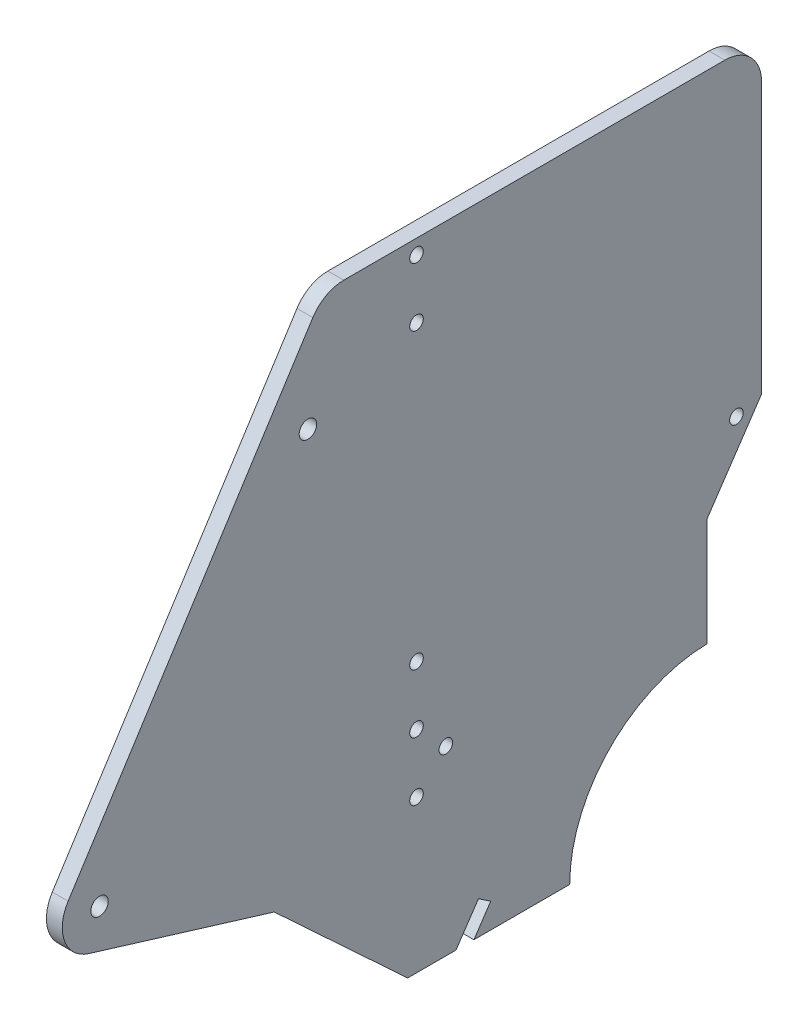
ISO-10303-21;
HEADER;
FILE_DESCRIPTION(('STEP AP214'),'2;1');
FILE_NAME('part.step','',(''),(''),'','','');
FILE_SCHEMA(('AUTOMOTIVE_DESIGN { 1 0 10303 214 1 1 1 1 }'));
ENDSEC;
DATA;
#1=APPLICATION_CONTEXT('core data for automotive mechanical design processes');
#2=APPLICATION_PROTOCOL_DEFINITION('international standard','automotive_design',2000,#1);
#3=PRODUCT_CONTEXT('',#1,'mechanical');
#4=PRODUCT('Part','Part','',(#3));
#5=PRODUCT_RELATED_PRODUCT_CATEGORY('part','',(#4));
#6=PRODUCT_DEFINITION_FORMATION('','',#4);
#7=PRODUCT_DEFINITION_CONTEXT('part definition',#1,'design');
#8=PRODUCT_DEFINITION('design','',#6,#7);
#9=PRODUCT_DEFINITION_SHAPE('','',#8);
#10=(LENGTH_UNIT() NAMED_UNIT(*) SI_UNIT(.MILLI.,.METRE.));
#11=(NAMED_UNIT(*) PLANE_ANGLE_UNIT() SI_UNIT($,.RADIAN.));
#12=(NAMED_UNIT(*) SI_UNIT($,.STERADIAN.) SOLID_ANGLE_UNIT());
#13=UNCERTAINTY_MEASURE_WITH_UNIT(LENGTH_MEASURE(1.E-05),#10,'distance_accuracy_value','');
#14=(GEOMETRIC_REPRESENTATION_CONTEXT(3) GLOBAL_UNCERTAINTY_ASSIGNED_CONTEXT((#13)) GLOBAL_UNIT_ASSIGNED_CONTEXT((#10,
#11,#12)) REPRESENTATION_CONTEXT('',''));
#15=CARTESIAN_POINT('',(0.,0.,0.));
#16=DIRECTION('',(0.,0.,1.));
#17=DIRECTION('',(1.,0.,0.));
#18=AXIS2_PLACEMENT_3D('',#15,#16,#17);
#19=CARTESIAN_POINT('',(4.318,57.4303706236677,286.371258716019));
#20=DIRECTION('',(1.,0.,0.));
#21=DIRECTION('',(0.,0.,-1.));
#22=AXIS2_PLACEMENT_3D('',#19,#20,#21);
#23=PLANE('',#22);
#24=CARTESIAN_POINT('',(4.318,48.,191.955990958433));
#25=DIRECTION('',(1.,0.,0.));
#26=DIRECTION('',(0.,0.,-1.));
#27=AXIS2_PLACEMENT_3D('',#24,#25,#26);
#28=CIRCLE('',#27,1.85000000000001);
#29=CARTESIAN_POINT('',(4.318,48.,190.105990958433));
#30=VERTEX_POINT('',#29);
#31=EDGE_CURVE('E362',#30,#30,#28,.T.);
#32=ORIENTED_EDGE('',*,*,#31,.F.);
#33=EDGE_LOOP('',(#32));
#34=FACE_BOUND('',#33,.T.);
#35=CARTESIAN_POINT('',(4.318,168.,199.955990958433));
#36=DIRECTION('',(1.,0.,0.));
#37=DIRECTION('',(0.,0.,-1.));
#38=AXIS2_PLACEMENT_3D('',#35,#36,#37);
#39=CIRCLE('',#38,1.85000000000001);
#40=CARTESIAN_POINT('',(4.318,168.,198.105990958433));
#41=VERTEX_POINT('',#40);
#42=EDGE_CURVE('E374',#41,#41,#39,.T.);
#43=ORIENTED_EDGE('',*,*,#42,.F.);
#44=EDGE_LOOP('',(#43));
#45=FACE_BOUND('',#44,.T.);
#46=CARTESIAN_POINT('',(4.318,72.,199.955990958433));
#47=DIRECTION('',(1.,0.,0.));
#48=DIRECTION('',(0.,0.,-1.));
#49=AXIS2_PLACEMENT_3D('',#46,#47,#48);
#50=CIRCLE('',#49,1.85);
#51=CARTESIAN_POINT('',(4.318,72.,198.105990958433));
#52=VERTEX_POINT('',#51);
#53=EDGE_CURVE('E386',#52,#52,#50,.T.);
#54=ORIENTED_EDGE('',*,*,#53,.F.);
#55=EDGE_LOOP('',(#54));
#56=FACE_BOUND('',#55,.T.);
#57=CARTESIAN_POINT('',(4.318,141.66058799526,229.557259723391));
#58=DIRECTION('',(1.,0.,0.));
#59=DIRECTION('',(0.,0.,-1.));
#60=AXIS2_PLACEMENT_3D('',#57,#58,#59);
#61=CIRCLE('',#60,2.38125);
#62=CARTESIAN_POINT('',(4.318,141.66058799526,227.176009723391));
#63=VERTEX_POINT('',#62);
#64=EDGE_CURVE('E398',#63,#63,#61,.T.);
#65=ORIENTED_EDGE('',*,*,#64,.F.);
#66=EDGE_LOOP('',(#65));
#67=FACE_BOUND('',#66,.T.);
#68=CARTESIAN_POINT('',(4.318,57.4303706236677,286.371258716019));
#69=DIRECTION('',(1.,0.,0.));
#70=DIRECTION('',(0.,0.,-1.));
#71=AXIS2_PLACEMENT_3D('',#68,#69,#70);
#72=CIRCLE('',#71,10.16);
#73=CARTESIAN_POINT('',(4.318,62.8994192645341,294.933682844958));
#74=VERTEX_POINT('',#73);
#75=CARTESIAN_POINT('',(4.318,47.7140898962469,289.341021135128));
#76=VERTEX_POINT('',#75);
#77=EDGE_CURVE('E208',#74,#76,#72,.T.);
#78=ORIENTED_EDGE('',*,*,#77,.T.);
#79=DIRECTION('',(0.,-0.292299450699678,-0.956326843250082));
#80=VECTOR('',#79,1.);
#81=CARTESIAN_POINT('',(4.318,47.7140898962469,289.341021135128));
#82=LINE('',#81,#80);
#83=CARTESIAN_POINT('',(4.318,32.254,238.759677477281));
#84=VERTEX_POINT('',#83);
#85=EDGE_CURVE('E116',#76,#84,#82,.T.);
#86=ORIENTED_EDGE('',*,*,#85,.T.);
#87=DIRECTION('',(0.,-0.680213162113875,-0.733014361446652));
#88=VECTOR('',#87,1.);
#89=CARTESIAN_POINT('',(4.318,32.254,238.759677477281));
#90=LINE('',#89,#88);
#91=CARTESIAN_POINT('',(4.318,-1.52400000000001,202.359677477281));
#92=VERTEX_POINT('',#91);
#93=EDGE_CURVE('E247',#84,#92,#90,.T.);
#94=ORIENTED_EDGE('',*,*,#93,.T.);
#95=DIRECTION('',(0.,0.,-1.));
#96=VECTOR('',#95,1.);
#97=CARTESIAN_POINT('',(4.318,-1.52400000000001,202.359677477281));
#98=LINE('',#97,#96);
#99=CARTESIAN_POINT('',(4.318,-1.52400000000001,189.184910369531));
#100=VERTEX_POINT('',#99);
#101=EDGE_CURVE('E266',#92,#100,#98,.T.);
#102=ORIENTED_EDGE('',*,*,#101,.T.);
#103=DIRECTION('',(0.,0.829037572555045,-0.559192903470742));
#104=VECTOR('',#103,1.);
#105=CARTESIAN_POINT('',(4.318,7.54457737783298,183.068077692539));
#106=LINE('',#105,#104);
#107=CARTESIAN_POINT('',(4.318,7.54457737783298,183.068077692539));
#108=VERTEX_POINT('',#107);
#109=EDGE_CURVE('E263',#100,#108,#106,.T.);
#110=ORIENTED_EDGE('',*,*,#109,.T.);
#111=DIRECTION('',(0.,-0.559192903470741,-0.829037572555046));
#112=VECTOR('',#111,1.);
#113=CARTESIAN_POINT('',(4.318,7.54457737783298,183.068077692539));
#114=LINE('',#113,#112);
#115=CARTESIAN_POINT('',(4.318,5.2864074531702,179.720203101964));
#116=VERTEX_POINT('',#115);
#117=EDGE_CURVE('E265',#108,#116,#114,.T.);
#118=ORIENTED_EDGE('',*,*,#117,.T.);
#119=DIRECTION('',(0.,-0.829037572555045,0.559192903470741));
#120=VECTOR('',#119,1.);
#121=CARTESIAN_POINT('',(4.318,5.2864074531702,179.720203101964));
#122=LINE('',#121,#120);
#123=CARTESIAN_POINT('',(4.318,-1.52400000000001,184.313880932294));
#124=VERTEX_POINT('',#123);
#125=EDGE_CURVE('E268',#116,#124,#122,.T.);
#126=ORIENTED_EDGE('',*,*,#125,.T.);
#127=DIRECTION('',(0.,0.,-1.));
#128=VECTOR('',#127,1.);
#129=CARTESIAN_POINT('',(4.318,-1.52400000000001,184.313880932294));
#130=LINE('',#129,#128);
#131=CARTESIAN_POINT('',(4.318,-1.524,158.188157253853));
#132=VERTEX_POINT('',#131);
#133=EDGE_CURVE('E274',#124,#132,#130,.T.);
#134=ORIENTED_EDGE('',*,*,#133,.T.);
#135=CARTESIAN_POINT('',(4.318,-1.524,120.082140817488));
#136=DIRECTION('',(-1.,0.,0.));
#137=DIRECTION('',(0.,0.,-1.));
#138=AXIS2_PLACEMENT_3D('',#135,#136,#137);
#139=CIRCLE('',#138,38.1060164363649);
#140=CARTESIAN_POINT('',(4.318,36.576,120.759258716019));
#141=VERTEX_POINT('',#140);
#142=EDGE_CURVE('E276',#132,#141,#139,.T.);
#143=ORIENTED_EDGE('',*,*,#142,.T.);
#144=DIRECTION('',(0.,1.,0.));
#145=VECTOR('',#144,1.);
#146=CARTESIAN_POINT('',(4.318,36.576,120.759258716019));
#147=LINE('',#146,#145);
#148=CARTESIAN_POINT('',(4.318,66.032,120.759258716019));
#149=VERTEX_POINT('',#148);
#150=EDGE_CURVE('E278',#141,#149,#147,.T.);
#151=ORIENTED_EDGE('',*,*,#150,.T.);
#152=DIRECTION('',(0.,0.829037572555048,-0.559192903470737));
#153=VECTOR('',#152,1.);
#154=CARTESIAN_POINT('',(4.318,66.032,120.759258716019));
#155=LINE('',#154,#153);
#156=CARTESIAN_POINT('',(4.318,88.0777389727626,105.889220018806));
#157=VERTEX_POINT('',#156);
#158=EDGE_CURVE('E280',#149,#157,#155,.T.);
#159=ORIENTED_EDGE('',*,*,#158,.T.);
#160=DIRECTION('',(0.,1.,0.));
#161=VECTOR('',#160,1.);
#162=CARTESIAN_POINT('',(4.318,88.0777389727626,105.889220018806));
#163=LINE('',#162,#161);
#164=CARTESIAN_POINT('',(4.318,161.954,105.889220018806));
#165=VERTEX_POINT('',#164);
#166=EDGE_CURVE('E282',#157,#165,#163,.T.);
#167=ORIENTED_EDGE('',*,*,#166,.T.);
#168=CARTESIAN_POINT('',(4.318,161.954,115.889220018806));
#169=DIRECTION('',(1.,0.,0.));
#170=DIRECTION('',(0.,0.,-1.));
#171=AXIS2_PLACEMENT_3D('',#168,#169,#170);
#172=CIRCLE('',#171,10.);
#173=CARTESIAN_POINT('',(4.318,171.954,115.889220018806));
#174=VERTEX_POINT('',#173);
#175=EDGE_CURVE('E159',#165,#174,#172,.T.);
#176=ORIENTED_EDGE('',*,*,#175,.T.);
#177=DIRECTION('',(0.,0.,1.));
#178=VECTOR('',#177,1.);
#179=CARTESIAN_POINT('',(4.318,171.954,115.889220018806));
#180=LINE('',#179,#178);
#181=CARTESIAN_POINT('',(4.318,171.954,219.799081889071));
#182=VERTEX_POINT('',#181);
#183=EDGE_CURVE('E153',#174,#182,#180,.T.);
#184=ORIENTED_EDGE('',*,*,#183,.T.);
#185=CARTESIAN_POINT('',(4.318,161.954,219.799081889071));
#186=DIRECTION('',(1.,0.,0.));
#187=DIRECTION('',(0.,0.,1.));
#188=AXIS2_PLACEMENT_3D('',#185,#186,#187);
#189=CIRCLE('',#188,10.);
#190=CARTESIAN_POINT('',(4.318,167.336921890617,228.226664693144));
#191=VERTEX_POINT('',#190);
#192=EDGE_CURVE('E157',#182,#191,#189,.T.);
#193=ORIENTED_EDGE('',*,*,#192,.T.);
#194=DIRECTION('',(0.,-0.842758280407383,0.538292189061657));
#195=VECTOR('',#194,1.);
#196=CARTESIAN_POINT('',(4.318,167.336921890617,228.226664693144));
#197=LINE('',#196,#195);
#198=EDGE_CURVE('E49',#191,#74,#197,.T.);
#199=ORIENTED_EDGE('',*,*,#198,.T.);
#200=EDGE_LOOP('',(#78,#86,#94,#102,#110,#118,#126,#134,#143,#151,#159,#167,#176,#184,#193,#199));
#201=FACE_BOUND('',#200,.T.);
#202=CARTESIAN_POINT('',(4.318,57.4303706236677,286.371258716019));
#203=DIRECTION('',(1.,0.,0.));
#204=DIRECTION('',(0.,0.,-1.));
#205=AXIS2_PLACEMENT_3D('',#202,#203,#204);
#206=CIRCLE('',#205,2.38125);
#207=CARTESIAN_POINT('',(4.318,57.4303706236677,283.990008716019));
#208=VERTEX_POINT('',#207);
#209=EDGE_CURVE('E181',#208,#208,#206,.T.);
#210=ORIENTED_EDGE('',*,*,#209,.F.);
#211=EDGE_LOOP('',(#210));
#212=FACE_BOUND('',#211,.T.);
#213=CARTESIAN_POINT('',(4.318,86.216867447635,112.732319414281));
#214=DIRECTION('',(1.,0.,0.));
#215=DIRECTION('',(0.,0.,-1.));
#216=AXIS2_PLACEMENT_3D('',#213,#214,#215);
#217=CIRCLE('',#216,1.85000000006904);
#218=CARTESIAN_POINT('',(4.318,86.216867447635,110.882319414212));
#219=VERTEX_POINT('',#218);
#220=EDGE_CURVE('E392',#219,#219,#217,.T.);
#221=ORIENTED_EDGE('',*,*,#220,.F.);
#222=EDGE_LOOP('',(#221));
#223=FACE_BOUND('',#222,.T.);
#224=CARTESIAN_POINT('',(4.318,152.,199.955990958433));
#225=DIRECTION('',(1.,0.,0.));
#226=DIRECTION('',(0.,0.,-1.));
#227=AXIS2_PLACEMENT_3D('',#224,#225,#226);
#228=CIRCLE('',#227,1.85);
#229=CARTESIAN_POINT('',(4.318,152.,198.105990958433));
#230=VERTEX_POINT('',#229);
#231=EDGE_CURVE('E380',#230,#230,#228,.T.);
#232=ORIENTED_EDGE('',*,*,#231,.F.);
#233=EDGE_LOOP('',(#232));
#234=FACE_BOUND('',#233,.T.);
#235=CARTESIAN_POINT('',(4.318,40.,199.955990958433));
#236=DIRECTION('',(1.,0.,0.));
#237=DIRECTION('',(0.,0.,-1.));
#238=AXIS2_PLACEMENT_3D('',#235,#236,#237);
#239=CIRCLE('',#238,1.85000000000001);
#240=CARTESIAN_POINT('',(4.318,40.,198.105990958433));
#241=VERTEX_POINT('',#240);
#242=EDGE_CURVE('E368',#241,#241,#239,.T.);
#243=ORIENTED_EDGE('',*,*,#242,.F.);
#244=EDGE_LOOP('',(#243));
#245=FACE_BOUND('',#244,.T.);
#246=CARTESIAN_POINT('',(4.318,56.,199.955990958433));
#247=DIRECTION('',(1.,0.,0.));
#248=DIRECTION('',(0.,0.,-1.));
#249=AXIS2_PLACEMENT_3D('',#246,#247,#248);
#250=CIRCLE('',#249,1.85000000000001);
#251=CARTESIAN_POINT('',(4.318,56.,198.105990958433));
#252=VERTEX_POINT('',#251);
#253=EDGE_CURVE('E353',#252,#252,#250,.T.);
#254=ORIENTED_EDGE('',*,*,#253,.F.);
#255=EDGE_LOOP('',(#254));
#256=FACE_BOUND('',#255,.T.);
#257=ADVANCED_FACE('F32',(#34,#45,#56,#67,#201,#212,#223,#234,#245,#256),#23,.T.);
#258=CARTESIAN_POINT('',(0.,57.4303706236677,286.371258716019));
#259=DIRECTION('',(1.,0.,0.));
#260=DIRECTION('',(0.,0.,-1.));
#261=AXIS2_PLACEMENT_3D('',#258,#259,#260);
#262=PLANE('',#261);
#263=CARTESIAN_POINT('',(0.,57.4303706236677,286.371258716019));
#264=DIRECTION('',(1.,0.,0.));
#265=DIRECTION('',(0.,0.,-1.));
#266=AXIS2_PLACEMENT_3D('',#263,#264,#265);
#267=CIRCLE('',#266,10.16);
#268=CARTESIAN_POINT('',(0.,62.8994192645341,294.933682844958));
#269=VERTEX_POINT('',#268);
#270=CARTESIAN_POINT('',(0.,47.7140898962469,289.341021135128));
#271=VERTEX_POINT('',#270);
#272=EDGE_CURVE('E177',#269,#271,#267,.T.);
#273=ORIENTED_EDGE('',*,*,#272,.F.);
#274=DIRECTION('',(0.,-0.842758280407383,0.538292189061657));
#275=VECTOR('',#274,1.);
#276=CARTESIAN_POINT('',(0.,167.336921890617,228.226664693144));
#277=LINE('',#276,#275);
#278=CARTESIAN_POINT('',(0.,167.336921890617,228.226664693144));
#279=VERTEX_POINT('',#278);
#280=EDGE_CURVE('E108',#279,#269,#277,.T.);
#281=ORIENTED_EDGE('',*,*,#280,.F.);
#282=CARTESIAN_POINT('',(0.,161.954,219.799081889071));
#283=DIRECTION('',(1.,0.,0.));
#284=DIRECTION('',(0.,0.,1.));
#285=AXIS2_PLACEMENT_3D('',#282,#283,#284);
#286=CIRCLE('',#285,10.);
#287=CARTESIAN_POINT('',(0.,171.954,219.799081889071));
#288=VERTEX_POINT('',#287);
#289=EDGE_CURVE('E102',#288,#279,#286,.T.);
#290=ORIENTED_EDGE('',*,*,#289,.F.);
#291=DIRECTION('',(0.,0.,1.));
#292=VECTOR('',#291,1.);
#293=CARTESIAN_POINT('',(0.,171.954,115.889220018806));
#294=LINE('',#293,#292);
#295=CARTESIAN_POINT('',(0.,171.954,115.889220018806));
#296=VERTEX_POINT('',#295);
#297=EDGE_CURVE('E167',#296,#288,#294,.T.);
#298=ORIENTED_EDGE('',*,*,#297,.F.);
#299=CARTESIAN_POINT('',(0.,161.954,115.889220018806));
#300=DIRECTION('',(1.,0.,0.));
#301=DIRECTION('',(0.,0.,-1.));
#302=AXIS2_PLACEMENT_3D('',#299,#300,#301);
#303=CIRCLE('',#302,10.);
#304=CARTESIAN_POINT('',(0.,161.954,105.889220018806));
#305=VERTEX_POINT('',#304);
#306=EDGE_CURVE('E203',#305,#296,#303,.T.);
#307=ORIENTED_EDGE('',*,*,#306,.F.);
#308=DIRECTION('',(0.,1.,0.));
#309=VECTOR('',#308,1.);
#310=CARTESIAN_POINT('',(0.,88.0777389727626,105.889220018806));
#311=LINE('',#310,#309);
#312=CARTESIAN_POINT('',(0.,88.0777389727626,105.889220018806));
#313=VERTEX_POINT('',#312);
#314=EDGE_CURVE('E201',#313,#305,#311,.T.);
#315=ORIENTED_EDGE('',*,*,#314,.F.);
#316=DIRECTION('',(0.,0.829037572555048,-0.559192903470737));
#317=VECTOR('',#316,1.);
#318=CARTESIAN_POINT('',(0.,66.032,120.759258716019));
#319=LINE('',#318,#317);
#320=CARTESIAN_POINT('',(0.,66.032,120.759258716019));
#321=VERTEX_POINT('',#320);
#322=EDGE_CURVE('E199',#321,#313,#319,.T.);
#323=ORIENTED_EDGE('',*,*,#322,.F.);
#324=DIRECTION('',(0.,1.,0.));
#325=VECTOR('',#324,1.);
#326=CARTESIAN_POINT('',(0.,36.576,120.759258716019));
#327=LINE('',#326,#325);
#328=CARTESIAN_POINT('',(0.,36.576,120.759258716019));
#329=VERTEX_POINT('',#328);
#330=EDGE_CURVE('E197',#329,#321,#327,.T.);
#331=ORIENTED_EDGE('',*,*,#330,.F.);
#332=CARTESIAN_POINT('',(0.,-1.524,120.082140817488));
#333=DIRECTION('',(-1.,0.,0.));
#334=DIRECTION('',(0.,0.,-1.));
#335=AXIS2_PLACEMENT_3D('',#332,#333,#334);
#336=CIRCLE('',#335,38.1060164363649);
#337=CARTESIAN_POINT('',(0.,-1.524,158.188157253853));
#338=VERTEX_POINT('',#337);
#339=EDGE_CURVE('E195',#338,#329,#336,.T.);
#340=ORIENTED_EDGE('',*,*,#339,.F.);
#341=DIRECTION('',(0.,0.,-1.));
#342=VECTOR('',#341,1.);
#343=CARTESIAN_POINT('',(0.,-1.52400000000001,184.313880932294));
#344=LINE('',#343,#342);
#345=CARTESIAN_POINT('',(0.,-1.52400000000001,184.313880932294));
#346=VERTEX_POINT('',#345);
#347=EDGE_CURVE('E193',#346,#338,#344,.T.);
#348=ORIENTED_EDGE('',*,*,#347,.F.);
#349=DIRECTION('',(0.,-0.829037572555045,0.559192903470741));
#350=VECTOR('',#349,1.);
#351=CARTESIAN_POINT('',(0.,5.2864074531702,179.720203101964));
#352=LINE('',#351,#350);
#353=CARTESIAN_POINT('',(0.,5.2864074531702,179.720203101964));
#354=VERTEX_POINT('',#353);
#355=EDGE_CURVE('E191',#354,#346,#352,.T.);
#356=ORIENTED_EDGE('',*,*,#355,.F.);
#357=DIRECTION('',(0.,-0.559192903470741,-0.829037572555046));
#358=VECTOR('',#357,1.);
#359=CARTESIAN_POINT('',(0.,7.54457737783298,183.068077692539));
#360=LINE('',#359,#358);
#361=CARTESIAN_POINT('',(0.,7.54457737783298,183.068077692539));
#362=VERTEX_POINT('',#361);
#363=EDGE_CURVE('E189',#362,#354,#360,.T.);
#364=ORIENTED_EDGE('',*,*,#363,.F.);
#365=DIRECTION('',(0.,0.829037572555045,-0.559192903470742));
#366=VECTOR('',#365,1.);
#367=CARTESIAN_POINT('',(0.,7.54457737783298,183.068077692539));
#368=LINE('',#367,#366);
#369=CARTESIAN_POINT('',(0.,-1.52400000000001,189.184910369531));
#370=VERTEX_POINT('',#369);
#371=EDGE_CURVE('E187',#370,#362,#368,.T.);
#372=ORIENTED_EDGE('',*,*,#371,.F.);
#373=DIRECTION('',(0.,0.,-1.));
#374=VECTOR('',#373,1.);
#375=CARTESIAN_POINT('',(0.,-1.52400000000001,202.359677477281));
#376=LINE('',#375,#374);
#377=CARTESIAN_POINT('',(0.,-1.52400000000001,202.359677477281));
#378=VERTEX_POINT('',#377);
#379=EDGE_CURVE('E185',#378,#370,#376,.T.);
#380=ORIENTED_EDGE('',*,*,#379,.F.);
#381=DIRECTION('',(0.,-0.680213162113875,-0.733014361446652));
#382=VECTOR('',#381,1.);
#383=CARTESIAN_POINT('',(0.,32.254,238.759677477281));
#384=LINE('',#383,#382);
#385=CARTESIAN_POINT('',(0.,32.254,238.759677477281));
#386=VERTEX_POINT('',#385);
#387=EDGE_CURVE('E183',#386,#378,#384,.T.);
#388=ORIENTED_EDGE('',*,*,#387,.F.);
#389=DIRECTION('',(0.,-0.292299450699678,-0.956326843250082));
#390=VECTOR('',#389,1.);
#391=CARTESIAN_POINT('',(0.,47.7140898962469,289.341021135128));
#392=LINE('',#391,#390);
#393=EDGE_CURVE('E180',#271,#386,#392,.T.);
#394=ORIENTED_EDGE('',*,*,#393,.F.);
#395=EDGE_LOOP('',(#273,#281,#290,#298,#307,#315,#323,#331,#340,#348,#356,#364,#372,#380,#388,#394));
#396=FACE_BOUND('',#395,.T.);
#397=CARTESIAN_POINT('',(0.,57.4303706236677,286.371258716019));
#398=DIRECTION('',(1.,0.,0.));
#399=DIRECTION('',(0.,0.,-1.));
#400=AXIS2_PLACEMENT_3D('',#397,#398,#399);
#401=CIRCLE('',#400,2.38125);
#402=CARTESIAN_POINT('',(0.,57.4303706236677,283.990008716019));
#403=VERTEX_POINT('',#402);
#404=EDGE_CURVE('E401',#403,#403,#401,.T.);
#405=ORIENTED_EDGE('',*,*,#404,.T.);
#406=EDGE_LOOP('',(#405));
#407=FACE_BOUND('',#406,.T.);
#408=CARTESIAN_POINT('',(0.,141.66058799526,229.557259723391));
#409=DIRECTION('',(1.,0.,0.));
#410=DIRECTION('',(0.,0.,-1.));
#411=AXIS2_PLACEMENT_3D('',#408,#409,#410);
#412=CIRCLE('',#411,2.38125);
#413=CARTESIAN_POINT('',(0.,141.66058799526,227.176009723391));
#414=VERTEX_POINT('',#413);
#415=EDGE_CURVE('E395',#414,#414,#412,.T.);
#416=ORIENTED_EDGE('',*,*,#415,.T.);
#417=EDGE_LOOP('',(#416));
#418=FACE_BOUND('',#417,.T.);
#419=CARTESIAN_POINT('',(0.,86.216867447635,112.732319414281));
#420=DIRECTION('',(1.,0.,0.));
#421=DIRECTION('',(0.,0.,-1.));
#422=AXIS2_PLACEMENT_3D('',#419,#420,#421);
#423=CIRCLE('',#422,1.85000000006904);
#424=CARTESIAN_POINT('',(0.,86.216867447635,110.882319414212));
#425=VERTEX_POINT('',#424);
#426=EDGE_CURVE('E389',#425,#425,#423,.T.);
#427=ORIENTED_EDGE('',*,*,#426,.T.);
#428=EDGE_LOOP('',(#427));
#429=FACE_BOUND('',#428,.T.);
#430=CARTESIAN_POINT('',(0.,72.,199.955990958433));
#431=DIRECTION('',(1.,0.,0.));
#432=DIRECTION('',(0.,0.,-1.));
#433=AXIS2_PLACEMENT_3D('',#430,#431,#432);
#434=CIRCLE('',#433,1.85);
#435=CARTESIAN_POINT('',(0.,72.,198.105990958433));
#436=VERTEX_POINT('',#435);
#437=EDGE_CURVE('E383',#436,#436,#434,.T.);
#438=ORIENTED_EDGE('',*,*,#437,.T.);
#439=EDGE_LOOP('',(#438));
#440=FACE_BOUND('',#439,.T.);
#441=CARTESIAN_POINT('',(0.,152.,199.955990958433));
#442=DIRECTION('',(1.,0.,0.));
#443=DIRECTION('',(0.,0.,-1.));
#444=AXIS2_PLACEMENT_3D('',#441,#442,#443);
#445=CIRCLE('',#444,1.85);
#446=CARTESIAN_POINT('',(0.,152.,198.105990958433));
#447=VERTEX_POINT('',#446);
#448=EDGE_CURVE('E377',#447,#447,#445,.T.);
#449=ORIENTED_EDGE('',*,*,#448,.T.);
#450=EDGE_LOOP('',(#449));
#451=FACE_BOUND('',#450,.T.);
#452=CARTESIAN_POINT('',(0.,168.,199.955990958433));
#453=DIRECTION('',(1.,0.,0.));
#454=DIRECTION('',(0.,0.,-1.));
#455=AXIS2_PLACEMENT_3D('',#452,#453,#454);
#456=CIRCLE('',#455,1.85000000000001);
#457=CARTESIAN_POINT('',(0.,168.,198.105990958433));
#458=VERTEX_POINT('',#457);
#459=EDGE_CURVE('E371',#458,#458,#456,.T.);
#460=ORIENTED_EDGE('',*,*,#459,.T.);
#461=EDGE_LOOP('',(#460));
#462=FACE_BOUND('',#461,.T.);
#463=CARTESIAN_POINT('',(0.,40.,199.955990958433));
#464=DIRECTION('',(1.,0.,0.));
#465=DIRECTION('',(0.,0.,-1.));
#466=AXIS2_PLACEMENT_3D('',#463,#464,#465);
#467=CIRCLE('',#466,1.85000000000001);
#468=CARTESIAN_POINT('',(0.,40.,198.105990958433));
#469=VERTEX_POINT('',#468);
#470=EDGE_CURVE('E365',#469,#469,#467,.T.);
#471=ORIENTED_EDGE('',*,*,#470,.T.);
#472=EDGE_LOOP('',(#471));
#473=FACE_BOUND('',#472,.T.);
#474=CARTESIAN_POINT('',(0.,48.,191.955990958433));
#475=DIRECTION('',(1.,0.,0.));
#476=DIRECTION('',(0.,0.,-1.));
#477=AXIS2_PLACEMENT_3D('',#474,#475,#476);
#478=CIRCLE('',#477,1.85000000000001);
#479=CARTESIAN_POINT('',(0.,48.,190.105990958433));
#480=VERTEX_POINT('',#479);
#481=EDGE_CURVE('E359',#480,#480,#478,.T.);
#482=ORIENTED_EDGE('',*,*,#481,.T.);
#483=EDGE_LOOP('',(#482));
#484=FACE_BOUND('',#483,.T.);
#485=CARTESIAN_POINT('',(0.,56.,199.955990958433));
#486=DIRECTION('',(1.,0.,0.));
#487=DIRECTION('',(0.,0.,-1.));
#488=AXIS2_PLACEMENT_3D('',#485,#486,#487);
#489=CIRCLE('',#488,1.85000000000001);
#490=CARTESIAN_POINT('',(0.,56.,198.105990958433));
#491=VERTEX_POINT('',#490);
#492=EDGE_CURVE('E356',#491,#491,#489,.T.);
#493=ORIENTED_EDGE('',*,*,#492,.T.);
#494=EDGE_LOOP('',(#493));
#495=FACE_BOUND('',#494,.T.);
#496=ADVANCED_FACE('F251',(#396,#407,#418,#429,#440,#451,#462,#473,#484,#495),#262,.F.);
#497=CARTESIAN_POINT('',(4.318,57.4303706236677,286.371258716019));
#498=DIRECTION('',(-1.,0.,0.));
#499=DIRECTION('',(0.,0.,1.));
#500=AXIS2_PLACEMENT_3D('',#497,#498,#499);
#501=CYLINDRICAL_SURFACE('',#500,10.16);
#502=ORIENTED_EDGE('',*,*,#272,.T.);
#503=DIRECTION('',(-1.,0.,0.));
#504=VECTOR('',#503,1.);
#505=CARTESIAN_POINT('',(4.318,47.7140898962469,289.341021135128));
#506=LINE('',#505,#504);
#507=EDGE_CURVE('E11',#76,#271,#506,.T.);
#508=ORIENTED_EDGE('',*,*,#507,.F.);
#509=ORIENTED_EDGE('',*,*,#77,.F.);
#510=DIRECTION('',(-1.,0.,0.));
#511=VECTOR('',#510,1.);
#512=CARTESIAN_POINT('',(4.318,62.8994192645341,294.933682844958));
#513=LINE('',#512,#511);
#514=EDGE_CURVE('E173',#74,#269,#513,.T.);
#515=ORIENTED_EDGE('',*,*,#514,.T.);
#516=EDGE_LOOP('',(#502,#508,#509,#515));
#517=FACE_BOUND('',#516,.T.);
#518=ADVANCED_FACE('F34',(#517),#501,.T.);
#519=CARTESIAN_POINT('',(4.318,47.7140898962469,289.341021135128));
#520=DIRECTION('',(0.,0.956326843250082,-0.292299450699678));
#521=DIRECTION('',(0.,0.292299450699678,0.956326843250082));
#522=AXIS2_PLACEMENT_3D('',#519,#520,#521);
#523=PLANE('',#522);
#524=ORIENTED_EDGE('',*,*,#393,.T.);
#525=DIRECTION('',(-1.,0.,0.));
#526=VECTOR('',#525,1.);
#527=CARTESIAN_POINT('',(4.318,32.254,238.759677477281));
#528=LINE('',#527,#526);
#529=EDGE_CURVE('E41',#84,#386,#528,.T.);
#530=ORIENTED_EDGE('',*,*,#529,.F.);
#531=ORIENTED_EDGE('',*,*,#85,.F.);
#532=ORIENTED_EDGE('',*,*,#507,.T.);
#533=EDGE_LOOP('',(#524,#530,#531,#532));
#534=FACE_BOUND('',#533,.T.);
#535=ADVANCED_FACE('F596',(#534),#523,.F.);
#536=CARTESIAN_POINT('',(4.318,32.254,238.759677477281));
#537=DIRECTION('',(0.,0.733014361446653,-0.680213162113875));
#538=DIRECTION('',(0.,0.680213162113875,0.733014361446653));
#539=AXIS2_PLACEMENT_3D('',#536,#537,#538);
#540=PLANE('',#539);
#541=ORIENTED_EDGE('',*,*,#387,.T.);
#542=DIRECTION('',(-1.,0.,0.));
#543=VECTOR('',#542,1.);
#544=CARTESIAN_POINT('',(4.318,-1.52400000000001,202.359677477281));
#545=LINE('',#544,#543);
#546=EDGE_CURVE('E239',#92,#378,#545,.T.);
#547=ORIENTED_EDGE('',*,*,#546,.F.);
#548=ORIENTED_EDGE('',*,*,#93,.F.);
#549=ORIENTED_EDGE('',*,*,#529,.T.);
#550=EDGE_LOOP('',(#541,#547,#548,#549));
#551=FACE_BOUND('',#550,.T.);
#552=ADVANCED_FACE('F245',(#551),#540,.F.);
#553=CARTESIAN_POINT('',(4.318,-1.52400000000001,202.359677477281));
#554=DIRECTION('',(0.,1.,0.));
#555=DIRECTION('',(0.,0.,1.));
#556=AXIS2_PLACEMENT_3D('',#553,#554,#555);
#557=PLANE('',#556);
#558=ORIENTED_EDGE('',*,*,#379,.T.);
#559=DIRECTION('',(-1.,0.,0.));
#560=VECTOR('',#559,1.);
#561=CARTESIAN_POINT('',(4.318,-1.52400000000001,189.184910369531));
#562=LINE('',#561,#560);
#563=EDGE_CURVE('E236',#100,#370,#562,.T.);
#564=ORIENTED_EDGE('',*,*,#563,.F.);
#565=ORIENTED_EDGE('',*,*,#101,.F.);
#566=ORIENTED_EDGE('',*,*,#546,.T.);
#567=EDGE_LOOP('',(#558,#564,#565,#566));
#568=FACE_BOUND('',#567,.T.);
#569=ADVANCED_FACE('F257',(#568),#557,.F.);
#570=CARTESIAN_POINT('',(4.318,7.54457737783298,183.068077692539));
#571=DIRECTION('',(0.,0.559192903470742,0.829037572555045));
#572=DIRECTION('',(0.,-0.829037572555045,0.559192903470742));
#573=AXIS2_PLACEMENT_3D('',#570,#571,#572);
#574=PLANE('',#573);
#575=ORIENTED_EDGE('',*,*,#371,.T.);
#576=DIRECTION('',(-1.,0.,0.));
#577=VECTOR('',#576,1.);
#578=CARTESIAN_POINT('',(4.318,7.54457737783298,183.068077692539));
#579=LINE('',#578,#577);
#580=EDGE_CURVE('E233',#108,#362,#579,.T.);
#581=ORIENTED_EDGE('',*,*,#580,.F.);
#582=ORIENTED_EDGE('',*,*,#109,.F.);
#583=ORIENTED_EDGE('',*,*,#563,.T.);
#584=EDGE_LOOP('',(#575,#581,#582,#583));
#585=FACE_BOUND('',#584,.T.);
#586=ADVANCED_FACE('F261',(#585),#574,.F.);
#587=CARTESIAN_POINT('',(4.318,7.54457737783298,183.068077692539));
#588=DIRECTION('',(0.,0.829037572555046,-0.559192903470741));
#589=DIRECTION('',(0.,0.559192903470741,0.829037572555046));
#590=AXIS2_PLACEMENT_3D('',#587,#588,#589);
#591=PLANE('',#590);
#592=ORIENTED_EDGE('',*,*,#363,.T.);
#593=DIRECTION('',(-1.,0.,0.));
#594=VECTOR('',#593,1.);
#595=CARTESIAN_POINT('',(4.318,5.2864074531702,179.720203101964));
#596=LINE('',#595,#594);
#597=EDGE_CURVE('E230',#116,#354,#596,.T.);
#598=ORIENTED_EDGE('',*,*,#597,.F.);
#599=ORIENTED_EDGE('',*,*,#117,.F.);
#600=ORIENTED_EDGE('',*,*,#580,.T.);
#601=EDGE_LOOP('',(#592,#598,#599,#600));
#602=FACE_BOUND('',#601,.T.);
#603=ADVANCED_FACE('F561',(#602),#591,.F.);
#604=CARTESIAN_POINT('',(4.318,5.2864074531702,179.720203101964));
#605=DIRECTION('',(0.,-0.559192903470741,-0.829037572555046));
#606=DIRECTION('',(0.,0.829037572555046,-0.559192903470741));
#607=AXIS2_PLACEMENT_3D('',#604,#605,#606);
#608=PLANE('',#607);
#609=ORIENTED_EDGE('',*,*,#355,.T.);
#610=DIRECTION('',(-1.,0.,0.));
#611=VECTOR('',#610,1.);
#612=CARTESIAN_POINT('',(4.318,-1.52400000000001,184.313880932294));
#613=LINE('',#612,#611);
#614=EDGE_CURVE('E227',#124,#346,#613,.T.);
#615=ORIENTED_EDGE('',*,*,#614,.F.);
#616=ORIENTED_EDGE('',*,*,#125,.F.);
#617=ORIENTED_EDGE('',*,*,#597,.T.);
#618=EDGE_LOOP('',(#609,#615,#616,#617));
#619=FACE_BOUND('',#618,.T.);
#620=ADVANCED_FACE('F551',(#619),#608,.F.);
#621=CARTESIAN_POINT('',(4.318,-1.52400000000001,184.313880932294));
#622=DIRECTION('',(0.,1.,0.));
#623=DIRECTION('',(0.,0.,1.));
#624=AXIS2_PLACEMENT_3D('',#621,#622,#623);
#625=PLANE('',#624);
#626=ORIENTED_EDGE('',*,*,#347,.T.);
#627=DIRECTION('',(-1.,0.,0.));
#628=VECTOR('',#627,1.);
#629=CARTESIAN_POINT('',(4.318,-1.524,158.188157253853));
#630=LINE('',#629,#628);
#631=EDGE_CURVE('E224',#132,#338,#630,.T.);
#632=ORIENTED_EDGE('',*,*,#631,.F.);
#633=ORIENTED_EDGE('',*,*,#133,.F.);
#634=ORIENTED_EDGE('',*,*,#614,.T.);
#635=EDGE_LOOP('',(#626,#632,#633,#634));
#636=FACE_BOUND('',#635,.T.);
#637=ADVANCED_FACE('F541',(#636),#625,.F.);
#638=CARTESIAN_POINT('',(4.318,-1.524,120.082140817488));
#639=DIRECTION('',(-1.,0.,0.));
#640=DIRECTION('',(0.,0.,1.));
#641=AXIS2_PLACEMENT_3D('',#638,#639,#640);
#642=CYLINDRICAL_SURFACE('',#641,38.1060164363649);
#643=ORIENTED_EDGE('',*,*,#339,.T.);
#644=DIRECTION('',(-1.,0.,0.));
#645=VECTOR('',#644,1.);
#646=CARTESIAN_POINT('',(4.318,36.576,120.759258716019));
#647=LINE('',#646,#645);
#648=EDGE_CURVE('E221',#141,#329,#647,.T.);
#649=ORIENTED_EDGE('',*,*,#648,.F.);
#650=ORIENTED_EDGE('',*,*,#142,.F.);
#651=ORIENTED_EDGE('',*,*,#631,.T.);
#652=EDGE_LOOP('',(#643,#649,#650,#651));
#653=FACE_BOUND('',#652,.T.);
#654=ADVANCED_FACE('F531',(#653),#642,.F.);
#655=CARTESIAN_POINT('',(4.318,36.576,120.759258716019));
#656=DIRECTION('',(0.,0.,1.));
#657=DIRECTION('',(0.,-1.,0.));
#658=AXIS2_PLACEMENT_3D('',#655,#656,#657);
#659=PLANE('',#658);
#660=ORIENTED_EDGE('',*,*,#330,.T.);
#661=DIRECTION('',(-1.,0.,0.));
#662=VECTOR('',#661,1.);
#663=CARTESIAN_POINT('',(4.318,66.032,120.759258716019));
#664=LINE('',#663,#662);
#665=EDGE_CURVE('E218',#149,#321,#664,.T.);
#666=ORIENTED_EDGE('',*,*,#665,.F.);
#667=ORIENTED_EDGE('',*,*,#150,.F.);
#668=ORIENTED_EDGE('',*,*,#648,.T.);
#669=EDGE_LOOP('',(#660,#666,#667,#668));
#670=FACE_BOUND('',#669,.T.);
#671=ADVANCED_FACE('F521',(#670),#659,.F.);
#672=CARTESIAN_POINT('',(4.318,66.032,120.759258716019));
#673=DIRECTION('',(0.,0.559192903470737,0.829037572555048));
#674=DIRECTION('',(0.,-0.829037572555049,0.559192903470737));
#675=AXIS2_PLACEMENT_3D('',#672,#673,#674);
#676=PLANE('',#675);
#677=ORIENTED_EDGE('',*,*,#322,.T.);
#678=DIRECTION('',(-1.,0.,0.));
#679=VECTOR('',#678,1.);
#680=CARTESIAN_POINT('',(4.318,88.0777389727626,105.889220018806));
#681=LINE('',#680,#679);
#682=EDGE_CURVE('E215',#157,#313,#681,.T.);
#683=ORIENTED_EDGE('',*,*,#682,.F.);
#684=ORIENTED_EDGE('',*,*,#158,.F.);
#685=ORIENTED_EDGE('',*,*,#665,.T.);
#686=EDGE_LOOP('',(#677,#683,#684,#685));
#687=FACE_BOUND('',#686,.T.);
#688=ADVANCED_FACE('F512',(#687),#676,.F.);
#689=CARTESIAN_POINT('',(4.318,88.0777389727626,105.889220018806));
#690=DIRECTION('',(0.,0.,1.));
#691=DIRECTION('',(1.,0.,0.));
#692=AXIS2_PLACEMENT_3D('',#689,#690,#691);
#693=PLANE('',#692);
#694=ORIENTED_EDGE('',*,*,#314,.T.);
#695=DIRECTION('',(-1.,0.,0.));
#696=VECTOR('',#695,1.);
#697=CARTESIAN_POINT('',(4.318,161.954,105.889220018806));
#698=LINE('',#697,#696);
#699=EDGE_CURVE('E212',#165,#305,#698,.T.);
#700=ORIENTED_EDGE('',*,*,#699,.F.);
#701=ORIENTED_EDGE('',*,*,#166,.F.);
#702=ORIENTED_EDGE('',*,*,#682,.T.);
#703=EDGE_LOOP('',(#694,#700,#701,#702));
#704=FACE_BOUND('',#703,.T.);
#705=ADVANCED_FACE('F288',(#704),#693,.F.);
#706=CARTESIAN_POINT('',(4.318,161.954,115.889220018806));
#707=DIRECTION('',(-1.,0.,0.));
#708=DIRECTION('',(0.,0.,1.));
#709=AXIS2_PLACEMENT_3D('',#706,#707,#708);
#710=CYLINDRICAL_SURFACE('',#709,10.);
#711=ORIENTED_EDGE('',*,*,#306,.T.);
#712=DIRECTION('',(-1.,0.,0.));
#713=VECTOR('',#712,1.);
#714=CARTESIAN_POINT('',(4.318,171.954,115.889220018806));
#715=LINE('',#714,#713);
#716=EDGE_CURVE('E168',#174,#296,#715,.T.);
#717=ORIENTED_EDGE('',*,*,#716,.F.);
#718=ORIENTED_EDGE('',*,*,#175,.F.);
#719=ORIENTED_EDGE('',*,*,#699,.T.);
#720=EDGE_LOOP('',(#711,#717,#718,#719));
#721=FACE_BOUND('',#720,.T.);
#722=ADVANCED_FACE('F292',(#721),#710,.T.);
#723=CARTESIAN_POINT('',(4.318,171.954,115.889220018806));
#724=DIRECTION('',(0.,-1.,0.));
#725=DIRECTION('',(0.,0.,-1.));
#726=AXIS2_PLACEMENT_3D('',#723,#724,#725);
#727=PLANE('',#726);
#728=ORIENTED_EDGE('',*,*,#297,.T.);
#729=DIRECTION('',(-1.,0.,0.));
#730=VECTOR('',#729,1.);
#731=CARTESIAN_POINT('',(4.318,171.954,219.799081889071));
#732=LINE('',#731,#730);
#733=EDGE_CURVE('E164',#182,#288,#732,.T.);
#734=ORIENTED_EDGE('',*,*,#733,.F.);
#735=ORIENTED_EDGE('',*,*,#183,.F.);
#736=ORIENTED_EDGE('',*,*,#716,.T.);
#737=EDGE_LOOP('',(#728,#734,#735,#736));
#738=FACE_BOUND('',#737,.T.);
#739=ADVANCED_FACE('F165',(#738),#727,.F.);
#740=CARTESIAN_POINT('',(4.318,161.954,219.799081889071));
#741=DIRECTION('',(-1.,0.,0.));
#742=DIRECTION('',(0.,0.,1.));
#743=AXIS2_PLACEMENT_3D('',#740,#741,#742);
#744=CYLINDRICAL_SURFACE('',#743,10.);
#745=ORIENTED_EDGE('',*,*,#289,.T.);
#746=DIRECTION('',(-1.,0.,0.));
#747=VECTOR('',#746,1.);
#748=CARTESIAN_POINT('',(4.318,167.336921890617,228.226664693144));
#749=LINE('',#748,#747);
#750=EDGE_CURVE('E169',#191,#279,#749,.T.);
#751=ORIENTED_EDGE('',*,*,#750,.F.);
#752=ORIENTED_EDGE('',*,*,#192,.F.);
#753=ORIENTED_EDGE('',*,*,#733,.T.);
#754=EDGE_LOOP('',(#745,#751,#752,#753));
#755=FACE_BOUND('',#754,.T.);
#756=ADVANCED_FACE('F171',(#755),#744,.T.);
#757=CARTESIAN_POINT('',(4.318,167.336921890617,228.226664693144));
#758=DIRECTION('',(0.,-0.538292189061657,-0.842758280407383));
#759=DIRECTION('',(0.,0.842758280407383,-0.538292189061657));
#760=AXIS2_PLACEMENT_3D('',#757,#758,#759);
#761=PLANE('',#760);
#762=ORIENTED_EDGE('',*,*,#280,.T.);
#763=ORIENTED_EDGE('',*,*,#514,.F.);
#764=ORIENTED_EDGE('',*,*,#198,.F.);
#765=ORIENTED_EDGE('',*,*,#750,.T.);
#766=EDGE_LOOP('',(#762,#763,#764,#765));
#767=FACE_BOUND('',#766,.T.);
#768=ADVANCED_FACE('F296',(#767),#761,.F.);
#769=CARTESIAN_POINT('',(4.318,57.4303706236677,286.371258716019));
#770=DIRECTION('',(-1.,0.,0.));
#771=DIRECTION('',(0.,0.,1.));
#772=AXIS2_PLACEMENT_3D('',#769,#770,#771);
#773=CYLINDRICAL_SURFACE('',#772,2.38125);
#774=ORIENTED_EDGE('',*,*,#209,.T.);
#775=EDGE_LOOP('',(#774));
#776=FACE_BOUND('',#775,.T.);
#777=ORIENTED_EDGE('',*,*,#404,.F.);
#778=EDGE_LOOP('',(#777));
#779=FACE_BOUND('',#778,.T.);
#780=ADVANCED_FACE('F298',(#776,#779),#773,.F.);
#781=CARTESIAN_POINT('',(4.318,141.66058799526,229.557259723391));
#782=DIRECTION('',(-1.,0.,0.));
#783=DIRECTION('',(0.,0.,1.));
#784=AXIS2_PLACEMENT_3D('',#781,#782,#783);
#785=CYLINDRICAL_SURFACE('',#784,2.38125);
#786=ORIENTED_EDGE('',*,*,#64,.T.);
#787=EDGE_LOOP('',(#786));
#788=FACE_BOUND('',#787,.T.);
#789=ORIENTED_EDGE('',*,*,#415,.F.);
#790=EDGE_LOOP('',(#789));
#791=FACE_BOUND('',#790,.T.);
#792=ADVANCED_FACE('F304',(#788,#791),#785,.F.);
#793=CARTESIAN_POINT('',(4.318,86.216867447635,112.732319414281));
#794=DIRECTION('',(-1.,0.,0.));
#795=DIRECTION('',(0.,0.,1.));
#796=AXIS2_PLACEMENT_3D('',#793,#794,#795);
#797=CYLINDRICAL_SURFACE('',#796,1.85000000006904);
#798=ORIENTED_EDGE('',*,*,#220,.T.);
#799=EDGE_LOOP('',(#798));
#800=FACE_BOUND('',#799,.T.);
#801=ORIENTED_EDGE('',*,*,#426,.F.);
#802=EDGE_LOOP('',(#801));
#803=FACE_BOUND('',#802,.T.);
#804=ADVANCED_FACE('F320',(#800,#803),#797,.F.);
#805=CARTESIAN_POINT('',(4.318,72.,199.955990958433));
#806=DIRECTION('',(-1.,0.,0.));
#807=DIRECTION('',(0.,0.,1.));
#808=AXIS2_PLACEMENT_3D('',#805,#806,#807);
#809=CYLINDRICAL_SURFACE('',#808,1.85);
#810=ORIENTED_EDGE('',*,*,#53,.T.);
#811=EDGE_LOOP('',(#810));
#812=FACE_BOUND('',#811,.T.);
#813=ORIENTED_EDGE('',*,*,#437,.F.);
#814=EDGE_LOOP('',(#813));
#815=FACE_BOUND('',#814,.T.);
#816=ADVANCED_FACE('F324',(#812,#815),#809,.F.);
#817=CARTESIAN_POINT('',(4.318,152.,199.955990958433));
#818=DIRECTION('',(-1.,0.,0.));
#819=DIRECTION('',(0.,0.,1.));
#820=AXIS2_PLACEMENT_3D('',#817,#818,#819);
#821=CYLINDRICAL_SURFACE('',#820,1.85);
#822=ORIENTED_EDGE('',*,*,#231,.T.);
#823=EDGE_LOOP('',(#822));
#824=FACE_BOUND('',#823,.T.);
#825=ORIENTED_EDGE('',*,*,#448,.F.);
#826=EDGE_LOOP('',(#825));
#827=FACE_BOUND('',#826,.T.);
#828=ADVANCED_FACE('F328',(#824,#827),#821,.F.);
#829=CARTESIAN_POINT('',(4.318,168.,199.955990958433));
#830=DIRECTION('',(-1.,0.,0.));
#831=DIRECTION('',(0.,0.,1.));
#832=AXIS2_PLACEMENT_3D('',#829,#830,#831);
#833=CYLINDRICAL_SURFACE('',#832,1.85000000000001);
#834=ORIENTED_EDGE('',*,*,#42,.T.);
#835=EDGE_LOOP('',(#834));
#836=FACE_BOUND('',#835,.T.);
#837=ORIENTED_EDGE('',*,*,#459,.F.);
#838=EDGE_LOOP('',(#837));
#839=FACE_BOUND('',#838,.T.);
#840=ADVANCED_FACE('F332',(#836,#839),#833,.F.);
#841=CARTESIAN_POINT('',(4.318,40.,199.955990958433));
#842=DIRECTION('',(-1.,0.,0.));
#843=DIRECTION('',(0.,0.,1.));
#844=AXIS2_PLACEMENT_3D('',#841,#842,#843);
#845=CYLINDRICAL_SURFACE('',#844,1.85000000000001);
#846=ORIENTED_EDGE('',*,*,#242,.T.);
#847=EDGE_LOOP('',(#846));
#848=FACE_BOUND('',#847,.T.);
#849=ORIENTED_EDGE('',*,*,#470,.F.);
#850=EDGE_LOOP('',(#849));
#851=FACE_BOUND('',#850,.T.);
#852=ADVANCED_FACE('F336',(#848,#851),#845,.F.);
#853=CARTESIAN_POINT('',(4.318,48.,191.955990958433));
#854=DIRECTION('',(-1.,0.,0.));
#855=DIRECTION('',(0.,0.,1.));
#856=AXIS2_PLACEMENT_3D('',#853,#854,#855);
#857=CYLINDRICAL_SURFACE('',#856,1.85000000000001);
#858=ORIENTED_EDGE('',*,*,#31,.T.);
#859=EDGE_LOOP('',(#858));
#860=FACE_BOUND('',#859,.T.);
#861=ORIENTED_EDGE('',*,*,#481,.F.);
#862=EDGE_LOOP('',(#861));
#863=FACE_BOUND('',#862,.T.);
#864=ADVANCED_FACE('F340',(#860,#863),#857,.F.);
#865=CARTESIAN_POINT('',(4.318,56.,199.955990958433));
#866=DIRECTION('',(-1.,0.,0.));
#867=DIRECTION('',(0.,0.,1.));
#868=AXIS2_PLACEMENT_3D('',#865,#866,#867);
#869=CYLINDRICAL_SURFACE('',#868,1.85000000000001);
#870=ORIENTED_EDGE('',*,*,#253,.T.);
#871=EDGE_LOOP('',(#870));
#872=FACE_BOUND('',#871,.T.);
#873=ORIENTED_EDGE('',*,*,#492,.F.);
#874=EDGE_LOOP('',(#873));
#875=FACE_BOUND('',#874,.T.);
#876=ADVANCED_FACE('F344',(#872,#875),#869,.F.);
#877=CLOSED_SHELL('',(#257,#496,#518,#535,#552,#569,#586,#603,#620,#637,#654,#671,#688,#705,
#722,#739,#756,#768,#780,#792,#804,#816,#828,#840,#852,#864,#876));
#878=MANIFOLD_SOLID_BREP('B2',#877);
#879=ADVANCED_BREP_SHAPE_REPRESENTATION('',(#18,#878),#14);
#880=SHAPE_DEFINITION_REPRESENTATION(#9,#879);
ENDSEC;
END-ISO-10303-21;
